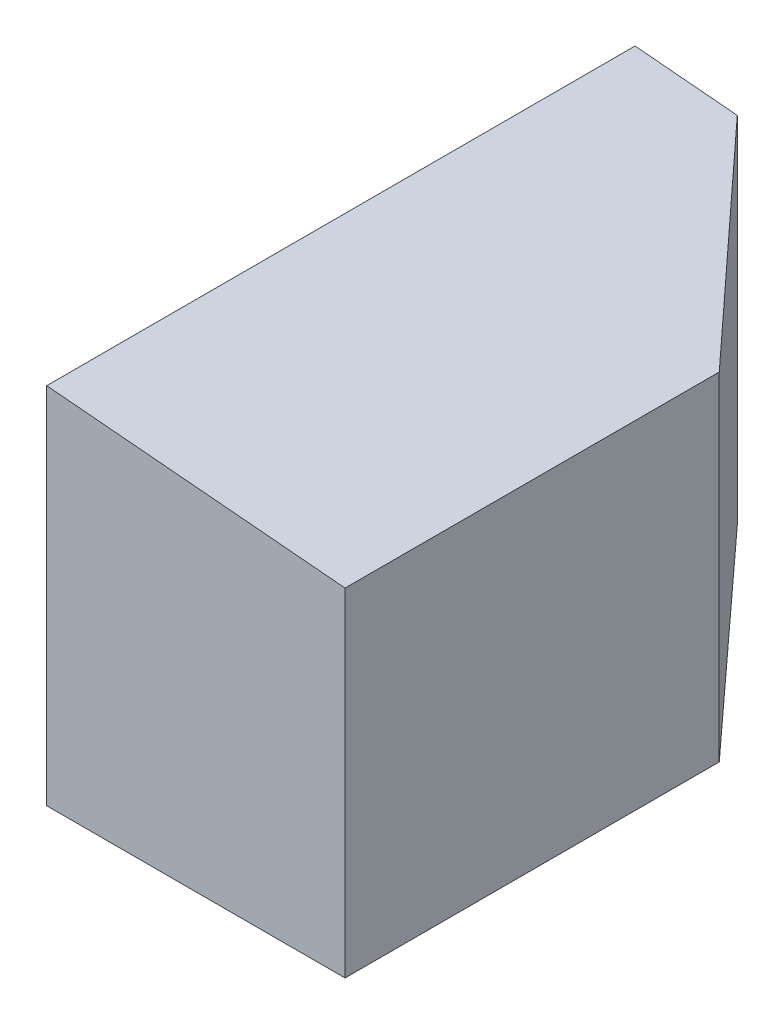
ISO-10303-21;
HEADER;
FILE_DESCRIPTION(('STEP AP214'),'2;1');
FILE_NAME('part.step','',(''),(''),'','','');
FILE_SCHEMA(('AUTOMOTIVE_DESIGN { 1 0 10303 214 1 1 1 1 }'));
ENDSEC;
DATA;
#1=APPLICATION_CONTEXT('core data for automotive mechanical design processes');
#2=APPLICATION_PROTOCOL_DEFINITION('international standard','automotive_design',2000,#1);
#3=PRODUCT_CONTEXT('',#1,'mechanical');
#4=PRODUCT('Part','Part','',(#3));
#5=PRODUCT_RELATED_PRODUCT_CATEGORY('part','',(#4));
#6=PRODUCT_DEFINITION_FORMATION('','',#4);
#7=PRODUCT_DEFINITION_CONTEXT('part definition',#1,'design');
#8=PRODUCT_DEFINITION('design','',#6,#7);
#9=PRODUCT_DEFINITION_SHAPE('','',#8);
#10=(LENGTH_UNIT() NAMED_UNIT(*) SI_UNIT(.MILLI.,.METRE.));
#11=(NAMED_UNIT(*) PLANE_ANGLE_UNIT() SI_UNIT($,.RADIAN.));
#12=(NAMED_UNIT(*) SI_UNIT($,.STERADIAN.) SOLID_ANGLE_UNIT());
#13=UNCERTAINTY_MEASURE_WITH_UNIT(LENGTH_MEASURE(1.E-05),#10,'distance_accuracy_value','');
#14=(GEOMETRIC_REPRESENTATION_CONTEXT(3) GLOBAL_UNCERTAINTY_ASSIGNED_CONTEXT((#13)) GLOBAL_UNIT_ASSIGNED_CONTEXT((#10,
#11,#12)) REPRESENTATION_CONTEXT('',''));
#15=CARTESIAN_POINT('',(0.,0.,0.));
#16=DIRECTION('',(0.,0.,1.));
#17=DIRECTION('',(1.,0.,0.));
#18=AXIS2_PLACEMENT_3D('',#15,#16,#17);
#19=CARTESIAN_POINT('',(-1643.22482801523,3048.54,-4930.));
#20=DIRECTION('',(-0.7375,0.,0.675347132962005));
#21=DIRECTION('',(0.675347132962005,0.,0.7375));
#22=AXIS2_PLACEMENT_3D('',#19,#20,#21);
#23=PLANE('',#22);
#24=DIRECTION('',(0.,-1.,0.));
#25=VECTOR('',#24,1.);
#26=CARTESIAN_POINT('',(-1643.22482801523,3048.54,-4930.));
#27=LINE('',#26,#25);
#28=CARTESIAN_POINT('',(-1643.22482801523,2973.58188526086,-4930.));
#29=VERTEX_POINT('',#28);
#30=CARTESIAN_POINT('',(-1643.22482801523,0.,-4930.));
#31=VERTEX_POINT('',#30);
#32=EDGE_CURVE('E11',#29,#31,#27,.T.);
#33=ORIENTED_EDGE('',*,*,#32,.F.);
#34=DIRECTION('',(0.674171370870133,-0.0589823522248682,0.736216031355679));
#35=VECTOR('',#34,1.);
#36=CARTESIAN_POINT('',(-1646.20547847503,2973.84265838602,-4933.25496268039));
#37=LINE('',#36,#35);
#38=CARTESIAN_POINT('',(0.,2829.81834118519,-3135.54755989553));
#39=VERTEX_POINT('',#38);
#40=EDGE_CURVE('E112',#29,#39,#37,.T.);
#41=ORIENTED_EDGE('',*,*,#40,.T.);
#42=DIRECTION('',(0.,-1.,0.));
#43=VECTOR('',#42,1.);
#44=CARTESIAN_POINT('',(-5.27355936696949E-13,3048.54,-3135.54755989553));
#45=LINE('',#44,#43);
#46=CARTESIAN_POINT('',(-5.27355936696949E-13,0.,-3135.54755989553));
#47=VERTEX_POINT('',#46);
#48=EDGE_CURVE('E83',#39,#47,#45,.T.);
#49=ORIENTED_EDGE('',*,*,#48,.T.);
#50=DIRECTION('',(-0.675347132962005,0.,-0.7375));
#51=VECTOR('',#50,1.);
#52=CARTESIAN_POINT('',(-1643.22482801523,0.,-4930.));
#53=LINE('',#52,#51);
#54=EDGE_CURVE('E97',#47,#31,#53,.T.);
#55=ORIENTED_EDGE('',*,*,#54,.T.);
#56=EDGE_LOOP('',(#33,#41,#49,#55));
#57=FACE_BOUND('',#56,.T.);
#58=ADVANCED_FACE('F35',(#57),#23,.F.);
#59=CARTESIAN_POINT('',(-2500.,3048.54,-4930.));
#60=DIRECTION('',(0.,0.,1.));
#61=DIRECTION('',(1.,0.,0.));
#62=AXIS2_PLACEMENT_3D('',#59,#60,#61);
#63=PLANE('',#62);
#64=DIRECTION('',(0.,-1.,0.));
#65=VECTOR('',#64,1.);
#66=CARTESIAN_POINT('',(-2500.,3048.54,-4930.));
#67=LINE('',#66,#65);
#68=CARTESIAN_POINT('',(-2500.,3048.54,-4930.));
#69=VERTEX_POINT('',#68);
#70=CARTESIAN_POINT('',(-2500.,0.,-4930.));
#71=VERTEX_POINT('',#70);
#72=EDGE_CURVE('E43',#69,#71,#67,.T.);
#73=ORIENTED_EDGE('',*,*,#72,.F.);
#74=DIRECTION('',(0.996194698091746,-0.0871557427476584,0.));
#75=VECTOR('',#74,1.);
#76=CARTESIAN_POINT('',(-2500.,3048.54,-4930.));
#77=LINE('',#76,#75);
#78=EDGE_CURVE('E50',#69,#29,#77,.T.);
#79=ORIENTED_EDGE('',*,*,#78,.T.);
#80=ORIENTED_EDGE('',*,*,#32,.T.);
#81=DIRECTION('',(-1.,0.,0.));
#82=VECTOR('',#81,1.);
#83=CARTESIAN_POINT('',(-2500.,0.,-4930.));
#84=LINE('',#83,#82);
#85=EDGE_CURVE('E109',#31,#71,#84,.T.);
#86=ORIENTED_EDGE('',*,*,#85,.T.);
#87=EDGE_LOOP('',(#73,#79,#80,#86));
#88=FACE_BOUND('',#87,.T.);
#89=ADVANCED_FACE('F122',(#88),#63,.F.);
#90=CARTESIAN_POINT('',(-2500.,3048.54,-4930.));
#91=DIRECTION('',(1.,0.,0.));
#92=DIRECTION('',(0.,0.,-1.));
#93=AXIS2_PLACEMENT_3D('',#90,#91,#92);
#94=PLANE('',#93);
#95=DIRECTION('',(0.,0.,1.));
#96=VECTOR('',#95,1.);
#97=CARTESIAN_POINT('',(-2500.,0.,-4930.));
#98=LINE('',#97,#96);
#99=CARTESIAN_POINT('',(-2500.,0.,0.));
#100=VERTEX_POINT('',#99);
#101=EDGE_CURVE('E92',#71,#100,#98,.T.);
#102=ORIENTED_EDGE('',*,*,#101,.T.);
#103=DIRECTION('',(0.,-1.,0.));
#104=VECTOR('',#103,1.);
#105=CARTESIAN_POINT('',(-2500.,3048.54,0.));
#106=LINE('',#105,#104);
#107=CARTESIAN_POINT('',(-2500.,3048.54,0.));
#108=VERTEX_POINT('',#107);
#109=EDGE_CURVE('E82',#108,#100,#106,.T.);
#110=ORIENTED_EDGE('',*,*,#109,.F.);
#111=DIRECTION('',(0.,0.,1.));
#112=VECTOR('',#111,1.);
#113=CARTESIAN_POINT('',(-2500.,3048.54,-4930.));
#114=LINE('',#113,#112);
#115=EDGE_CURVE('E98',#69,#108,#114,.T.);
#116=ORIENTED_EDGE('',*,*,#115,.F.);
#117=ORIENTED_EDGE('',*,*,#72,.T.);
#118=EDGE_LOOP('',(#102,#110,#116,#117));
#119=FACE_BOUND('',#118,.T.);
#120=ADVANCED_FACE('F107',(#119),#94,.F.);
#121=CARTESIAN_POINT('',(-2500.,3048.54,0.));
#122=DIRECTION('',(0.,0.,-1.));
#123=DIRECTION('',(-1.,0.,0.));
#124=AXIS2_PLACEMENT_3D('',#121,#122,#123);
#125=PLANE('',#124);
#126=DIRECTION('',(0.,-1.,0.));
#127=VECTOR('',#126,1.);
#128=CARTESIAN_POINT('',(0.,3048.54,0.));
#129=LINE('',#128,#127);
#130=CARTESIAN_POINT('',(0.,2829.81834118519,0.));
#131=VERTEX_POINT('',#130);
#132=CARTESIAN_POINT('',(0.,0.,0.));
#133=VERTEX_POINT('',#132);
#134=EDGE_CURVE('E70',#131,#133,#129,.T.);
#135=ORIENTED_EDGE('',*,*,#134,.F.);
#136=DIRECTION('',(0.996194698091746,-0.0871557427476584,0.));
#137=VECTOR('',#136,1.);
#138=CARTESIAN_POINT('',(-2500.,3048.54,0.));
#139=LINE('',#138,#137);
#140=EDGE_CURVE('E117',#108,#131,#139,.T.);
#141=ORIENTED_EDGE('',*,*,#140,.F.);
#142=ORIENTED_EDGE('',*,*,#109,.T.);
#143=DIRECTION('',(1.,0.,0.));
#144=VECTOR('',#143,1.);
#145=CARTESIAN_POINT('',(-2500.,0.,0.));
#146=LINE('',#145,#144);
#147=EDGE_CURVE('E87',#100,#133,#146,.T.);
#148=ORIENTED_EDGE('',*,*,#147,.T.);
#149=EDGE_LOOP('',(#135,#141,#142,#148));
#150=FACE_BOUND('',#149,.T.);
#151=ADVANCED_FACE('F88',(#150),#125,.F.);
#152=CARTESIAN_POINT('',(-5.27355936696949E-13,3048.54,-3135.54755989553));
#153=DIRECTION('',(-1.,0.,0.));
#154=DIRECTION('',(0.,0.,1.));
#155=AXIS2_PLACEMENT_3D('',#152,#153,#154);
#156=PLANE('',#155);
#157=ORIENTED_EDGE('',*,*,#48,.F.);
#158=DIRECTION('',(0.,0.,1.));
#159=VECTOR('',#158,1.);
#160=CARTESIAN_POINT('',(0.,2829.81834118519,-4930.));
#161=LINE('',#160,#159);
#162=EDGE_CURVE('E79',#39,#131,#161,.T.);
#163=ORIENTED_EDGE('',*,*,#162,.T.);
#164=ORIENTED_EDGE('',*,*,#134,.T.);
#165=DIRECTION('',(0.,0.,-1.));
#166=VECTOR('',#165,1.);
#167=CARTESIAN_POINT('',(-5.27355936696949E-13,0.,-3135.54755989553));
#168=LINE('',#167,#166);
#169=EDGE_CURVE('E75',#133,#47,#168,.T.);
#170=ORIENTED_EDGE('',*,*,#169,.T.);
#171=EDGE_LOOP('',(#157,#163,#164,#170));
#172=FACE_BOUND('',#171,.T.);
#173=ADVANCED_FACE('F73',(#172),#156,.F.);
#174=CARTESIAN_POINT('',(0.,0.,0.));
#175=DIRECTION('',(0.,1.,0.));
#176=DIRECTION('',(0.,0.,1.));
#177=AXIS2_PLACEMENT_3D('',#174,#175,#176);
#178=PLANE('',#177);
#179=ORIENTED_EDGE('',*,*,#54,.F.);
#180=ORIENTED_EDGE('',*,*,#169,.F.);
#181=ORIENTED_EDGE('',*,*,#147,.F.);
#182=ORIENTED_EDGE('',*,*,#101,.F.);
#183=ORIENTED_EDGE('',*,*,#85,.F.);
#184=EDGE_LOOP('',(#179,#180,#181,#182,#183));
#185=FACE_BOUND('',#184,.T.);
#186=ADVANCED_FACE('F94',(#185),#178,.F.);
#187=CARTESIAN_POINT('',(-2500.,3048.54,-4930.));
#188=DIRECTION('',(-0.0871557427476584,-0.996194698091746,0.));
#189=DIRECTION('',(0.996194698091746,-0.0871557427476584,0.));
#190=AXIS2_PLACEMENT_3D('',#187,#188,#189);
#191=PLANE('',#190);
#192=ORIENTED_EDGE('',*,*,#78,.F.);
#193=ORIENTED_EDGE('',*,*,#115,.T.);
#194=ORIENTED_EDGE('',*,*,#140,.T.);
#195=ORIENTED_EDGE('',*,*,#162,.F.);
#196=ORIENTED_EDGE('',*,*,#40,.F.);
#197=EDGE_LOOP('',(#192,#193,#194,#195,#196));
#198=FACE_BOUND('',#197,.T.);
#199=ADVANCED_FACE('F124',(#198),#191,.F.);
#200=CLOSED_SHELL('',(#58,#89,#120,#151,#173,#186,#199));
#201=MANIFOLD_SOLID_BREP('B2',#200);
#202=ADVANCED_BREP_SHAPE_REPRESENTATION('',(#18,#201),#14);
#203=SHAPE_DEFINITION_REPRESENTATION(#9,#202);
ENDSEC;
END-ISO-10303-21;
